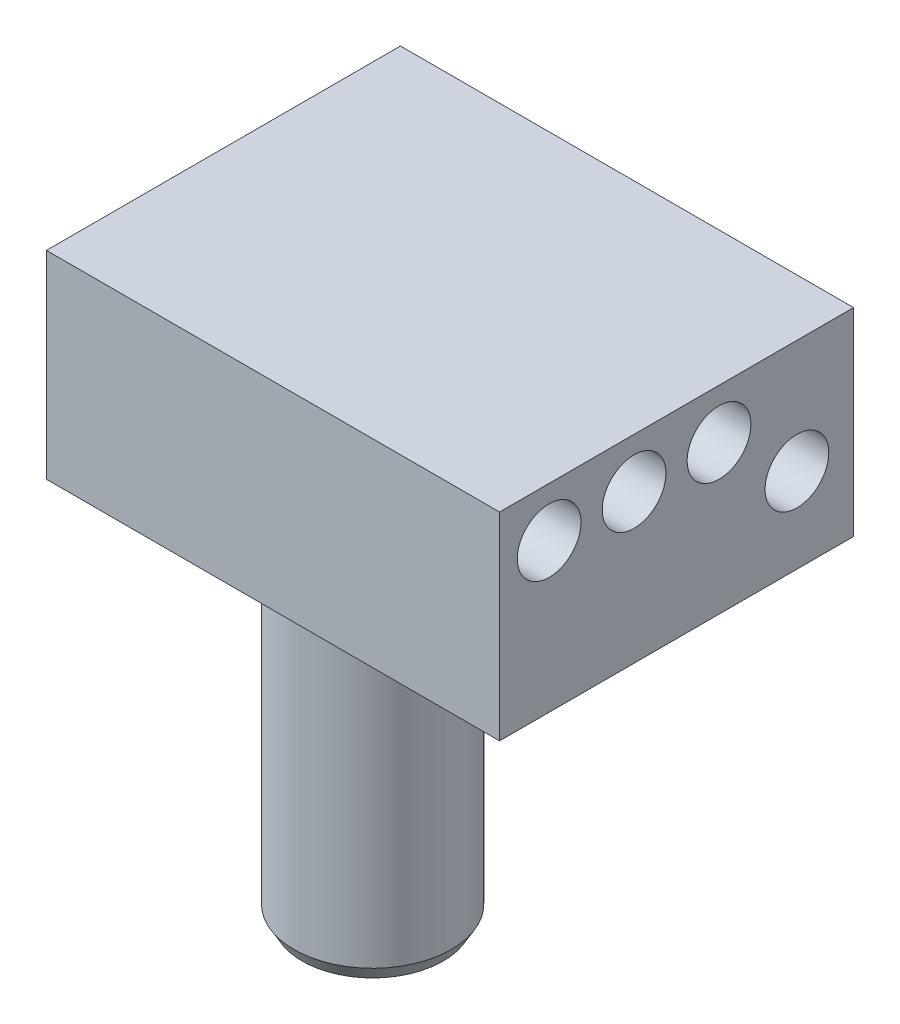
ISO-10303-21;
HEADER;
FILE_DESCRIPTION(('STEP AP214'),'2;1');
FILE_NAME('part.step','',(''),(''),'','','');
FILE_SCHEMA(('AUTOMOTIVE_DESIGN { 1 0 10303 214 1 1 1 1 }'));
ENDSEC;
DATA;
#1=APPLICATION_CONTEXT('core data for automotive mechanical design processes');
#2=APPLICATION_PROTOCOL_DEFINITION('international standard','automotive_design',2000,#1);
#3=PRODUCT_CONTEXT('',#1,'mechanical');
#4=PRODUCT('Part','Part','',(#3));
#5=PRODUCT_RELATED_PRODUCT_CATEGORY('part','',(#4));
#6=PRODUCT_DEFINITION_FORMATION('','',#4);
#7=PRODUCT_DEFINITION_CONTEXT('part definition',#1,'design');
#8=PRODUCT_DEFINITION('design','',#6,#7);
#9=PRODUCT_DEFINITION_SHAPE('','',#8);
#10=(LENGTH_UNIT() NAMED_UNIT(*) SI_UNIT(.MILLI.,.METRE.));
#11=(NAMED_UNIT(*) PLANE_ANGLE_UNIT() SI_UNIT($,.RADIAN.));
#12=(NAMED_UNIT(*) SI_UNIT($,.STERADIAN.) SOLID_ANGLE_UNIT());
#13=UNCERTAINTY_MEASURE_WITH_UNIT(LENGTH_MEASURE(1.E-05),#10,'distance_accuracy_value','');
#14=(GEOMETRIC_REPRESENTATION_CONTEXT(3) GLOBAL_UNCERTAINTY_ASSIGNED_CONTEXT((#13)) GLOBAL_UNIT_ASSIGNED_CONTEXT((#10,
#11,#12)) REPRESENTATION_CONTEXT('',''));
#15=CARTESIAN_POINT('',(0.,0.,0.));
#16=DIRECTION('',(0.,0.,1.));
#17=DIRECTION('',(1.,0.,0.));
#18=AXIS2_PLACEMENT_3D('',#15,#16,#17);
#19=CARTESIAN_POINT('',(20.,0.,0.));
#20=DIRECTION('',(-1.,0.,0.));
#21=DIRECTION('',(0.,0.,1.));
#22=AXIS2_PLACEMENT_3D('',#19,#20,#21);
#23=PLANE('',#22);
#24=DIRECTION('',(0.,1.,0.));
#25=VECTOR('',#24,1.);
#26=CARTESIAN_POINT('',(20.,-7.,-12.5));
#27=LINE('',#26,#25);
#28=CARTESIAN_POINT('',(20.,-7.,-12.5));
#29=VERTEX_POINT('',#28);
#30=CARTESIAN_POINT('',(20.,7.,-12.5));
#31=VERTEX_POINT('',#30);
#32=EDGE_CURVE('E122',#29,#31,#27,.T.);
#33=ORIENTED_EDGE('',*,*,#32,.T.);
#34=DIRECTION('',(0.,0.,1.));
#35=VECTOR('',#34,1.);
#36=CARTESIAN_POINT('',(20.,7.,12.5));
#37=LINE('',#36,#35);
#38=CARTESIAN_POINT('',(20.,7.,12.5));
#39=VERTEX_POINT('',#38);
#40=EDGE_CURVE('E126',#31,#39,#37,.T.);
#41=ORIENTED_EDGE('',*,*,#40,.T.);
#42=DIRECTION('',(0.,-1.,0.));
#43=VECTOR('',#42,1.);
#44=CARTESIAN_POINT('',(20.,-7.,12.5));
#45=LINE('',#44,#43);
#46=CARTESIAN_POINT('',(20.,-7.,12.5));
#47=VERTEX_POINT('',#46);
#48=EDGE_CURVE('E55',#39,#47,#45,.T.);
#49=ORIENTED_EDGE('',*,*,#48,.T.);
#50=DIRECTION('',(0.,0.,-1.));
#51=VECTOR('',#50,1.);
#52=CARTESIAN_POINT('',(20.,-7.,12.5));
#53=LINE('',#52,#51);
#54=EDGE_CURVE('E50',#47,#29,#53,.T.);
#55=ORIENTED_EDGE('',*,*,#54,.T.);
#56=EDGE_LOOP('',(#33,#41,#49,#55));
#57=FACE_BOUND('',#56,.T.);
#58=CARTESIAN_POINT('',(20.,-1.,-8.5));
#59=DIRECTION('',(1.,0.,0.));
#60=DIRECTION('',(0.,0.,-1.));
#61=AXIS2_PLACEMENT_3D('',#58,#59,#60);
#62=CIRCLE('',#61,2.25);
#63=CARTESIAN_POINT('',(20.,-1.,-10.75));
#64=VERTEX_POINT('',#63);
#65=EDGE_CURVE('E119',#64,#64,#62,.T.);
#66=ORIENTED_EDGE('',*,*,#65,.F.);
#67=EDGE_LOOP('',(#66));
#68=FACE_BOUND('',#67,.T.);
#69=CARTESIAN_POINT('',(20.,3.5,-3.));
#70=DIRECTION('',(1.,0.,0.));
#71=DIRECTION('',(0.,0.,-1.));
#72=AXIS2_PLACEMENT_3D('',#69,#70,#71);
#73=CIRCLE('',#72,2.25);
#74=CARTESIAN_POINT('',(20.,3.5,-5.25));
#75=VERTEX_POINT('',#74);
#76=EDGE_CURVE('E113',#75,#75,#73,.T.);
#77=ORIENTED_EDGE('',*,*,#76,.F.);
#78=EDGE_LOOP('',(#77));
#79=FACE_BOUND('',#78,.T.);
#80=CARTESIAN_POINT('',(20.,3.5,3.));
#81=DIRECTION('',(1.,0.,0.));
#82=DIRECTION('',(0.,0.,-1.));
#83=AXIS2_PLACEMENT_3D('',#80,#81,#82);
#84=CIRCLE('',#83,2.25);
#85=CARTESIAN_POINT('',(20.,3.5,0.749999999999999));
#86=VERTEX_POINT('',#85);
#87=EDGE_CURVE('E107',#86,#86,#84,.T.);
#88=ORIENTED_EDGE('',*,*,#87,.F.);
#89=EDGE_LOOP('',(#88));
#90=FACE_BOUND('',#89,.T.);
#91=CARTESIAN_POINT('',(20.,3.5,9.));
#92=DIRECTION('',(1.,0.,0.));
#93=DIRECTION('',(0.,0.,-1.));
#94=AXIS2_PLACEMENT_3D('',#91,#92,#93);
#95=CIRCLE('',#94,2.25);
#96=CARTESIAN_POINT('',(20.,3.5,6.75));
#97=VERTEX_POINT('',#96);
#98=EDGE_CURVE('E101',#97,#97,#95,.T.);
#99=ORIENTED_EDGE('',*,*,#98,.F.);
#100=EDGE_LOOP('',(#99));
#101=FACE_BOUND('',#100,.T.);
#102=ADVANCED_FACE('F35',(#57,#68,#79,#90,#101),#23,.F.);
#103=CARTESIAN_POINT('',(20.,-7.,-12.5));
#104=DIRECTION('',(0.,0.,1.));
#105=DIRECTION('',(1.,0.,0.));
#106=AXIS2_PLACEMENT_3D('',#103,#104,#105);
#107=PLANE('',#106);
#108=DIRECTION('',(-1.,0.,0.));
#109=VECTOR('',#108,1.);
#110=CARTESIAN_POINT('',(20.,-7.,-12.5));
#111=LINE('',#110,#109);
#112=CARTESIAN_POINT('',(-12.,-7.,-12.5));
#113=VERTEX_POINT('',#112);
#114=EDGE_CURVE('E130',#29,#113,#111,.T.);
#115=ORIENTED_EDGE('',*,*,#114,.T.);
#116=DIRECTION('',(0.,-1.,0.));
#117=VECTOR('',#116,1.);
#118=CARTESIAN_POINT('',(-12.,-7.,-12.5));
#119=LINE('',#118,#117);
#120=CARTESIAN_POINT('',(-12.,7.,-12.5));
#121=VERTEX_POINT('',#120);
#122=EDGE_CURVE('E87',#121,#113,#119,.T.);
#123=ORIENTED_EDGE('',*,*,#122,.F.);
#124=DIRECTION('',(-1.,0.,0.));
#125=VECTOR('',#124,1.);
#126=CARTESIAN_POINT('',(20.,7.,-12.5));
#127=LINE('',#126,#125);
#128=EDGE_CURVE('E135',#31,#121,#127,.T.);
#129=ORIENTED_EDGE('',*,*,#128,.F.);
#130=ORIENTED_EDGE('',*,*,#32,.F.);
#131=EDGE_LOOP('',(#115,#123,#129,#130));
#132=FACE_BOUND('',#131,.T.);
#133=ADVANCED_FACE('F150',(#132),#107,.F.);
#134=CARTESIAN_POINT('',(20.,7.,12.5));
#135=DIRECTION('',(0.,-1.,0.));
#136=DIRECTION('',(0.,0.,-1.));
#137=AXIS2_PLACEMENT_3D('',#134,#135,#136);
#138=PLANE('',#137);
#139=ORIENTED_EDGE('',*,*,#128,.T.);
#140=DIRECTION('',(0.,0.,-1.));
#141=VECTOR('',#140,1.);
#142=CARTESIAN_POINT('',(-12.,7.,-12.5));
#143=LINE('',#142,#141);
#144=CARTESIAN_POINT('',(-12.,7.,12.5));
#145=VERTEX_POINT('',#144);
#146=EDGE_CURVE('E97',#145,#121,#143,.T.);
#147=ORIENTED_EDGE('',*,*,#146,.F.);
#148=DIRECTION('',(-1.,0.,0.));
#149=VECTOR('',#148,1.);
#150=CARTESIAN_POINT('',(20.,7.,12.5));
#151=LINE('',#150,#149);
#152=EDGE_CURVE('E133',#39,#145,#151,.T.);
#153=ORIENTED_EDGE('',*,*,#152,.F.);
#154=ORIENTED_EDGE('',*,*,#40,.F.);
#155=EDGE_LOOP('',(#139,#147,#153,#154));
#156=FACE_BOUND('',#155,.T.);
#157=ADVANCED_FACE('F155',(#156),#138,.F.);
#158=CARTESIAN_POINT('',(20.,-7.,12.5));
#159=DIRECTION('',(0.,0.,-1.));
#160=DIRECTION('',(-1.,0.,0.));
#161=AXIS2_PLACEMENT_3D('',#158,#159,#160);
#162=PLANE('',#161);
#163=ORIENTED_EDGE('',*,*,#152,.T.);
#164=DIRECTION('',(0.,1.,0.));
#165=VECTOR('',#164,1.);
#166=CARTESIAN_POINT('',(-12.,-7.,12.5));
#167=LINE('',#166,#165);
#168=CARTESIAN_POINT('',(-12.,-7.,12.5));
#169=VERTEX_POINT('',#168);
#170=EDGE_CURVE('E176',#169,#145,#167,.T.);
#171=ORIENTED_EDGE('',*,*,#170,.F.);
#172=DIRECTION('',(-1.,0.,0.));
#173=VECTOR('',#172,1.);
#174=CARTESIAN_POINT('',(20.,-7.,12.5));
#175=LINE('',#174,#173);
#176=EDGE_CURVE('E95',#47,#169,#175,.T.);
#177=ORIENTED_EDGE('',*,*,#176,.F.);
#178=ORIENTED_EDGE('',*,*,#48,.F.);
#179=EDGE_LOOP('',(#163,#171,#177,#178));
#180=FACE_BOUND('',#179,.T.);
#181=ADVANCED_FACE('F164',(#180),#162,.F.);
#182=CARTESIAN_POINT('',(20.,-7.,12.5));
#183=DIRECTION('',(0.,1.,0.));
#184=DIRECTION('',(0.,0.,1.));
#185=AXIS2_PLACEMENT_3D('',#182,#183,#184);
#186=PLANE('',#185);
#187=DIRECTION('',(0.,0.,1.));
#188=VECTOR('',#187,1.);
#189=CARTESIAN_POINT('',(-12.,-7.,-12.5));
#190=LINE('',#189,#188);
#191=CARTESIAN_POINT('',(-12.,-7.,0.));
#192=VERTEX_POINT('',#191);
#193=EDGE_CURVE('E83',#192,#169,#190,.T.);
#194=ORIENTED_EDGE('',*,*,#193,.F.);
#195=CARTESIAN_POINT('',(-1.,-7.,0.));
#196=DIRECTION('',(0.,-1.,0.));
#197=DIRECTION('',(0.,0.,-1.));
#198=AXIS2_PLACEMENT_3D('',#195,#196,#197);
#199=CIRCLE('',#198,11.);
#200=EDGE_CURVE('E94',#192,#192,#199,.T.);
#201=ORIENTED_EDGE('',*,*,#200,.F.);
#202=EDGE_CURVE('E79',#113,#192,#190,.T.);
#203=ORIENTED_EDGE('',*,*,#202,.F.);
#204=ORIENTED_EDGE('',*,*,#114,.F.);
#205=ORIENTED_EDGE('',*,*,#54,.F.);
#206=ORIENTED_EDGE('',*,*,#176,.T.);
#207=EDGE_LOOP('',(#194,#201,#203,#204,#205,#206));
#208=FACE_BOUND('',#207,.T.);
#209=ADVANCED_FACE('F92',(#208),#186,.F.);
#210=CARTESIAN_POINT('',(20.,-1.,-8.5));
#211=DIRECTION('',(-1.,0.,0.));
#212=DIRECTION('',(0.,0.,1.));
#213=AXIS2_PLACEMENT_3D('',#210,#211,#212);
#214=CYLINDRICAL_SURFACE('',#213,2.25);
#215=ORIENTED_EDGE('',*,*,#65,.T.);
#216=EDGE_LOOP('',(#215));
#217=FACE_BOUND('',#216,.T.);
#218=CARTESIAN_POINT('',(0.,-1.,-8.5));
#219=DIRECTION('',(1.,0.,0.));
#220=DIRECTION('',(0.,0.,-1.));
#221=AXIS2_PLACEMENT_3D('',#218,#219,#220);
#222=CIRCLE('',#221,2.25);
#223=CARTESIAN_POINT('',(0.,-1.,-10.75));
#224=VERTEX_POINT('',#223);
#225=EDGE_CURVE('E116',#224,#224,#222,.T.);
#226=ORIENTED_EDGE('',*,*,#225,.F.);
#227=EDGE_LOOP('',(#226));
#228=FACE_BOUND('',#227,.T.);
#229=ADVANCED_FACE('F160',(#217,#228),#214,.F.);
#230=CARTESIAN_POINT('',(20.,3.5,-3.));
#231=DIRECTION('',(-1.,0.,0.));
#232=DIRECTION('',(0.,0.,1.));
#233=AXIS2_PLACEMENT_3D('',#230,#231,#232);
#234=CYLINDRICAL_SURFACE('',#233,2.25);
#235=ORIENTED_EDGE('',*,*,#76,.T.);
#236=EDGE_LOOP('',(#235));
#237=FACE_BOUND('',#236,.T.);
#238=CARTESIAN_POINT('',(0.,3.5,-3.));
#239=DIRECTION('',(1.,0.,0.));
#240=DIRECTION('',(0.,0.,-1.));
#241=AXIS2_PLACEMENT_3D('',#238,#239,#240);
#242=CIRCLE('',#241,2.25);
#243=CARTESIAN_POINT('',(0.,3.5,-5.25));
#244=VERTEX_POINT('',#243);
#245=EDGE_CURVE('E110',#244,#244,#242,.T.);
#246=ORIENTED_EDGE('',*,*,#245,.F.);
#247=EDGE_LOOP('',(#246));
#248=FACE_BOUND('',#247,.T.);
#249=ADVANCED_FACE('F243',(#237,#248),#234,.F.);
#250=CARTESIAN_POINT('',(20.,3.5,3.));
#251=DIRECTION('',(-1.,0.,0.));
#252=DIRECTION('',(0.,0.,1.));
#253=AXIS2_PLACEMENT_3D('',#250,#251,#252);
#254=CYLINDRICAL_SURFACE('',#253,2.25);
#255=ORIENTED_EDGE('',*,*,#87,.T.);
#256=EDGE_LOOP('',(#255));
#257=FACE_BOUND('',#256,.T.);
#258=CARTESIAN_POINT('',(0.,3.5,3.));
#259=DIRECTION('',(1.,0.,0.));
#260=DIRECTION('',(0.,0.,-1.));
#261=AXIS2_PLACEMENT_3D('',#258,#259,#260);
#262=CIRCLE('',#261,2.25);
#263=CARTESIAN_POINT('',(0.,3.5,0.749999999999999));
#264=VERTEX_POINT('',#263);
#265=EDGE_CURVE('E104',#264,#264,#262,.T.);
#266=ORIENTED_EDGE('',*,*,#265,.F.);
#267=EDGE_LOOP('',(#266));
#268=FACE_BOUND('',#267,.T.);
#269=ADVANCED_FACE('F240',(#257,#268),#254,.F.);
#270=CARTESIAN_POINT('',(20.,3.5,9.));
#271=DIRECTION('',(-1.,0.,0.));
#272=DIRECTION('',(0.,0.,1.));
#273=AXIS2_PLACEMENT_3D('',#270,#271,#272);
#274=CYLINDRICAL_SURFACE('',#273,2.25);
#275=ORIENTED_EDGE('',*,*,#98,.T.);
#276=EDGE_LOOP('',(#275));
#277=FACE_BOUND('',#276,.T.);
#278=CARTESIAN_POINT('',(0.,3.5,9.));
#279=DIRECTION('',(1.,0.,0.));
#280=DIRECTION('',(0.,0.,-1.));
#281=AXIS2_PLACEMENT_3D('',#278,#279,#280);
#282=CIRCLE('',#281,2.25);
#283=CARTESIAN_POINT('',(0.,3.5,6.75));
#284=VERTEX_POINT('',#283);
#285=EDGE_CURVE('E90',#284,#284,#282,.T.);
#286=ORIENTED_EDGE('',*,*,#285,.F.);
#287=EDGE_LOOP('',(#286));
#288=FACE_BOUND('',#287,.T.);
#289=ADVANCED_FACE('F237',(#277,#288),#274,.F.);
#290=CARTESIAN_POINT('',(0.,0.,0.));
#291=DIRECTION('',(1.,0.,0.));
#292=DIRECTION('',(0.,0.,-1.));
#293=AXIS2_PLACEMENT_3D('',#290,#291,#292);
#294=PLANE('',#293);
#295=ORIENTED_EDGE('',*,*,#285,.T.);
#296=EDGE_LOOP('',(#295));
#297=FACE_BOUND('',#296,.T.);
#298=ADVANCED_FACE('F236',(#297),#294,.T.);
#299=ORIENTED_EDGE('',*,*,#265,.T.);
#300=EDGE_LOOP('',(#299));
#301=FACE_BOUND('',#300,.T.);
#302=ADVANCED_FACE('F256',(#301),#294,.T.);
#303=ORIENTED_EDGE('',*,*,#245,.T.);
#304=EDGE_LOOP('',(#303));
#305=FACE_BOUND('',#304,.T.);
#306=ADVANCED_FACE('F234',(#305),#294,.T.);
#307=ORIENTED_EDGE('',*,*,#225,.T.);
#308=EDGE_LOOP('',(#307));
#309=FACE_BOUND('',#308,.T.);
#310=ADVANCED_FACE('F231',(#309),#294,.T.);
#311=CARTESIAN_POINT('',(-12.,0.,0.));
#312=DIRECTION('',(1.,0.,0.));
#313=DIRECTION('',(0.,0.,-1.));
#314=AXIS2_PLACEMENT_3D('',#311,#312,#313);
#315=PLANE('',#314);
#316=ORIENTED_EDGE('',*,*,#170,.T.);
#317=ORIENTED_EDGE('',*,*,#146,.T.);
#318=ORIENTED_EDGE('',*,*,#122,.T.);
#319=ORIENTED_EDGE('',*,*,#202,.T.);
#320=ORIENTED_EDGE('',*,*,#193,.T.);
#321=EDGE_LOOP('',(#316,#317,#318,#319,#320));
#322=FACE_BOUND('',#321,.T.);
#323=ADVANCED_FACE('F82',(#322),#315,.F.);
#324=CARTESIAN_POINT('',(-1.,-8.5,0.));
#325=DIRECTION('',(0.,1.,0.));
#326=DIRECTION('',(0.,0.,1.));
#327=AXIS2_PLACEMENT_3D('',#324,#325,#326);
#328=CYLINDRICAL_SURFACE('',#327,11.);
#329=CARTESIAN_POINT('',(-1.,-8.5,0.));
#330=DIRECTION('',(0.,-1.,0.));
#331=DIRECTION('',(0.,0.,-1.));
#332=AXIS2_PLACEMENT_3D('',#329,#330,#331);
#333=CIRCLE('',#332,11.);
#334=CARTESIAN_POINT('',(-1.,-8.5,-11.));
#335=VERTEX_POINT('',#334);
#336=EDGE_CURVE('E177',#335,#335,#333,.T.);
#337=ORIENTED_EDGE('',*,*,#336,.F.);
#338=EDGE_LOOP('',(#337));
#339=FACE_BOUND('',#338,.T.);
#340=ORIENTED_EDGE('',*,*,#200,.T.);
#341=EDGE_LOOP('',(#340));
#342=FACE_BOUND('',#341,.T.);
#343=ADVANCED_FACE('F224',(#339,#342),#328,.T.);
#344=CARTESIAN_POINT('',(-1.,-8.5,0.));
#345=DIRECTION('',(0.,-1.,0.));
#346=DIRECTION('',(0.,0.,-1.));
#347=AXIS2_PLACEMENT_3D('',#344,#345,#346);
#348=PLANE('',#347);
#349=CARTESIAN_POINT('',(-1.,-8.5,0.));
#350=DIRECTION('',(0.,-1.,0.));
#351=DIRECTION('',(0.,0.,-1.));
#352=AXIS2_PLACEMENT_3D('',#349,#350,#351);
#353=CIRCLE('',#352,10.);
#354=CARTESIAN_POINT('',(-1.,-8.5,-10.));
#355=VERTEX_POINT('',#354);
#356=EDGE_CURVE('E184',#355,#355,#353,.T.);
#357=ORIENTED_EDGE('',*,*,#356,.F.);
#358=EDGE_LOOP('',(#357));
#359=FACE_BOUND('',#358,.T.);
#360=ORIENTED_EDGE('',*,*,#336,.T.);
#361=EDGE_LOOP('',(#360));
#362=FACE_BOUND('',#361,.T.);
#363=ADVANCED_FACE('F205',(#359,#362),#348,.T.);
#364=CARTESIAN_POINT('',(-1.,-7.25,0.));
#365=DIRECTION('',(0.,-1.,0.));
#366=DIRECTION('',(0.,0.,-1.));
#367=AXIS2_PLACEMENT_3D('',#364,#365,#366);
#368=CYLINDRICAL_SURFACE('',#367,10.);
#369=CARTESIAN_POINT('',(-1.,-7.25,0.));
#370=DIRECTION('',(0.,-1.,0.));
#371=DIRECTION('',(0.,0.,-1.));
#372=AXIS2_PLACEMENT_3D('',#369,#370,#371);
#373=CIRCLE('',#372,10.);
#374=CARTESIAN_POINT('',(-1.,-7.25,-10.));
#375=VERTEX_POINT('',#374);
#376=EDGE_CURVE('E182',#375,#375,#373,.T.);
#377=ORIENTED_EDGE('',*,*,#376,.F.);
#378=EDGE_LOOP('',(#377));
#379=FACE_BOUND('',#378,.T.);
#380=ORIENTED_EDGE('',*,*,#356,.T.);
#381=EDGE_LOOP('',(#380));
#382=FACE_BOUND('',#381,.T.);
#383=ADVANCED_FACE('F215',(#379,#382),#368,.F.);
#384=CARTESIAN_POINT('',(-1.,-7.25,0.));
#385=DIRECTION('',(0.,-1.,0.));
#386=DIRECTION('',(0.,0.,-1.));
#387=AXIS2_PLACEMENT_3D('',#384,#385,#386);
#388=PLANE('',#387);
#389=CARTESIAN_POINT('',(-1.,-7.25,0.461771611412587));
#390=DIRECTION('',(0.,-1.,0.));
#391=DIRECTION('',(0.,0.,-1.));
#392=AXIS2_PLACEMENT_3D('',#389,#390,#391);
#393=CIRCLE('',#392,6.25);
#394=CARTESIAN_POINT('',(-1.,-7.25,-5.78822838858741));
#395=VERTEX_POINT('',#394);
#396=EDGE_CURVE('E187',#395,#395,#393,.T.);
#397=ORIENTED_EDGE('',*,*,#396,.F.);
#398=EDGE_LOOP('',(#397));
#399=FACE_BOUND('',#398,.T.);
#400=ORIENTED_EDGE('',*,*,#376,.T.);
#401=EDGE_LOOP('',(#400));
#402=FACE_BOUND('',#401,.T.);
#403=ADVANCED_FACE('F209',(#399,#402),#388,.T.);
#404=CARTESIAN_POINT('',(-1.,-7.25,0.461771611412587));
#405=DIRECTION('',(0.,-1.,0.));
#406=DIRECTION('',(0.,0.,-1.));
#407=AXIS2_PLACEMENT_3D('',#404,#405,#406);
#408=CYLINDRICAL_SURFACE('',#407,6.25);
#409=ORIENTED_EDGE('',*,*,#396,.T.);
#410=EDGE_LOOP('',(#409));
#411=FACE_BOUND('',#410,.T.);
#412=CARTESIAN_POINT('',(-1.,-8.5,0.461771611412587));
#413=DIRECTION('',(0.,-1.,0.));
#414=DIRECTION('',(0.,0.,-1.));
#415=AXIS2_PLACEMENT_3D('',#412,#413,#414);
#416=CIRCLE('',#415,6.25);
#417=CARTESIAN_POINT('',(-1.,-8.5,-5.78822838858741));
#418=VERTEX_POINT('',#417);
#419=EDGE_CURVE('E190',#418,#418,#416,.T.);
#420=ORIENTED_EDGE('',*,*,#419,.F.);
#421=EDGE_LOOP('',(#420));
#422=FACE_BOUND('',#421,.T.);
#423=ADVANCED_FACE('F203',(#411,#422),#408,.T.);
#424=CARTESIAN_POINT('',(-1.,-8.5,0.461771611412587));
#425=DIRECTION('',(0.,-1.,0.));
#426=DIRECTION('',(0.,0.,-1.));
#427=AXIS2_PLACEMENT_3D('',#424,#425,#426);
#428=CIRCLE('',#427,5.55625);
#429=CARTESIAN_POINT('',(-1.,-8.5,-5.09447838858741));
#430=VERTEX_POINT('',#429);
#431=EDGE_CURVE('E193',#430,#430,#428,.T.);
#432=ORIENTED_EDGE('',*,*,#431,.F.);
#433=EDGE_LOOP('',(#432));
#434=FACE_BOUND('',#433,.T.);
#435=ORIENTED_EDGE('',*,*,#419,.T.);
#436=EDGE_LOOP('',(#435));
#437=FACE_BOUND('',#436,.T.);
#438=ADVANCED_FACE('F200',(#434,#437),#348,.T.);
#439=CARTESIAN_POINT('',(-1.,-34.5,0.461771611412587));
#440=DIRECTION('',(0.,1.,0.));
#441=DIRECTION('',(0.,0.,1.));
#442=AXIS2_PLACEMENT_3D('',#439,#440,#441);
#443=CYLINDRICAL_SURFACE('',#442,5.55625);
#444=CARTESIAN_POINT('',(-1.,-33.5,0.461771611412587));
#445=DIRECTION('',(0.,-1.,0.));
#446=DIRECTION('',(0.,0.,-1.));
#447=AXIS2_PLACEMENT_3D('',#444,#445,#446);
#448=CIRCLE('',#447,5.55625);
#449=CARTESIAN_POINT('',(-1.,-33.5,-5.09447838858741));
#450=VERTEX_POINT('',#449);
#451=EDGE_CURVE('E11',#450,#450,#448,.F.);
#452=ORIENTED_EDGE('',*,*,#451,.T.);
#453=EDGE_LOOP('',(#452));
#454=FACE_BOUND('',#453,.T.);
#455=ORIENTED_EDGE('',*,*,#431,.T.);
#456=EDGE_LOOP('',(#455));
#457=FACE_BOUND('',#456,.T.);
#458=ADVANCED_FACE('F146',(#454,#457),#443,.T.);
#459=CARTESIAN_POINT('',(-1.,-34.5,0.461771611412587));
#460=DIRECTION('',(0.,-1.,0.));
#461=DIRECTION('',(0.,0.,-1.));
#462=AXIS2_PLACEMENT_3D('',#459,#460,#461);
#463=PLANE('',#462);
#464=CARTESIAN_POINT('',(-1.,-34.5,0.461771611412587));
#465=DIRECTION('',(0.,-1.,0.));
#466=DIRECTION('',(0.,0.,-1.));
#467=AXIS2_PLACEMENT_3D('',#464,#465,#466);
#468=CIRCLE('',#467,4.9788997308104);
#469=CARTESIAN_POINT('',(-1.,-34.5,-4.51712811939781));
#470=VERTEX_POINT('',#469);
#471=EDGE_CURVE('E43',#470,#470,#468,.T.);
#472=ORIENTED_EDGE('',*,*,#471,.T.);
#473=EDGE_LOOP('',(#472));
#474=FACE_BOUND('',#473,.T.);
#475=ADVANCED_FACE('F139',(#474),#463,.T.);
#476=CARTESIAN_POINT('',(-1.,-34.5,0.461771611412587));
#477=DIRECTION('',(0.,1.,0.));
#478=DIRECTION('',(0.,0.,1.));
#479=AXIS2_PLACEMENT_3D('',#476,#477,#478);
#480=CONICAL_SURFACE('',#479,4.9788997308104,0.523598775598296);
#481=ORIENTED_EDGE('',*,*,#451,.F.);
#482=EDGE_LOOP('',(#481));
#483=FACE_BOUND('',#482,.T.);
#484=ORIENTED_EDGE('',*,*,#471,.F.);
#485=EDGE_LOOP('',(#484));
#486=FACE_BOUND('',#485,.T.);
#487=ADVANCED_FACE('F37',(#483,#486),#480,.T.);
#488=CLOSED_SHELL('',(#102,#133,#157,#181,#209,#229,#249,#269,#289,#298,#302,#306,#310,#323,
#343,#363,#383,#403,#423,#438,#458,#475,#487));
#489=MANIFOLD_SOLID_BREP('B2',#488);
#490=ADVANCED_BREP_SHAPE_REPRESENTATION('',(#18,#489),#14);
#491=SHAPE_DEFINITION_REPRESENTATION(#9,#490);
ENDSEC;
END-ISO-10303-21;
